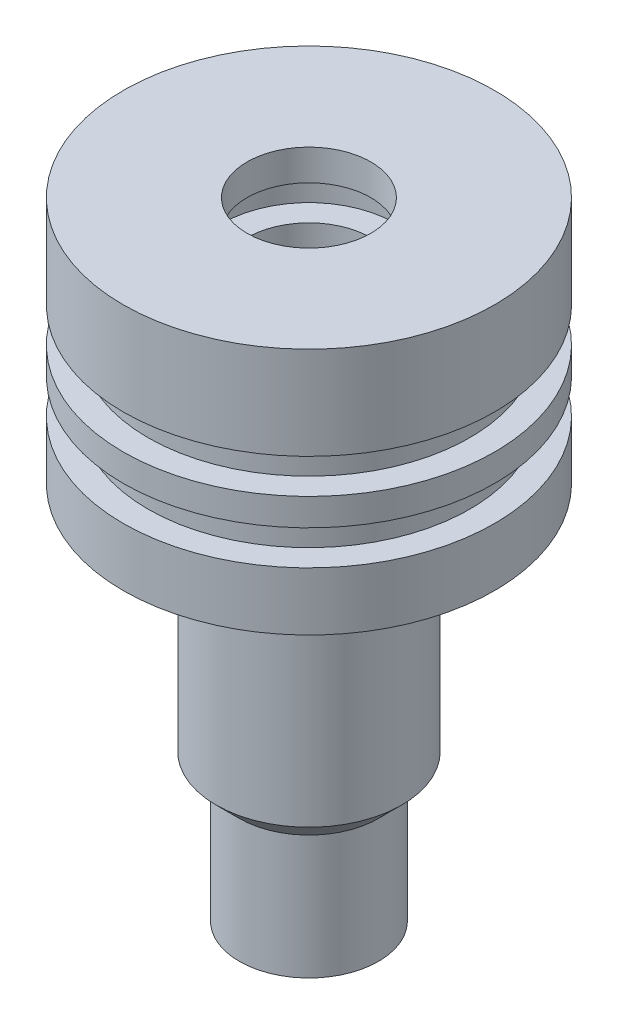
ISO-10303-21;
HEADER;
FILE_DESCRIPTION(('STEP AP214'),'2;1');
FILE_NAME('part.step','',(''),(''),'','','');
FILE_SCHEMA(('AUTOMOTIVE_DESIGN { 1 0 10303 214 1 1 1 1 }'));
ENDSEC;
DATA;
#1=APPLICATION_CONTEXT('core data for automotive mechanical design processes');
#2=APPLICATION_PROTOCOL_DEFINITION('international standard','automotive_design',2000,#1);
#3=PRODUCT_CONTEXT('',#1,'mechanical');
#4=PRODUCT('Part','Part','',(#3));
#5=PRODUCT_RELATED_PRODUCT_CATEGORY('part','',(#4));
#6=PRODUCT_DEFINITION_FORMATION('','',#4);
#7=PRODUCT_DEFINITION_CONTEXT('part definition',#1,'design');
#8=PRODUCT_DEFINITION('design','',#6,#7);
#9=PRODUCT_DEFINITION_SHAPE('','',#8);
#10=(LENGTH_UNIT() NAMED_UNIT(*) SI_UNIT(.MILLI.,.METRE.));
#11=(NAMED_UNIT(*) PLANE_ANGLE_UNIT() SI_UNIT($,.RADIAN.));
#12=(NAMED_UNIT(*) SI_UNIT($,.STERADIAN.) SOLID_ANGLE_UNIT());
#13=UNCERTAINTY_MEASURE_WITH_UNIT(LENGTH_MEASURE(1.E-05),#10,'distance_accuracy_value','');
#14=(GEOMETRIC_REPRESENTATION_CONTEXT(3) GLOBAL_UNCERTAINTY_ASSIGNED_CONTEXT((#13)) GLOBAL_UNIT_ASSIGNED_CONTEXT((#10,
#11,#12)) REPRESENTATION_CONTEXT('',''));
#15=CARTESIAN_POINT('',(0.,0.,0.));
#16=DIRECTION('',(0.,0.,1.));
#17=DIRECTION('',(1.,0.,0.));
#18=AXIS2_PLACEMENT_3D('',#15,#16,#17);
#19=CARTESIAN_POINT('',(0.,0.,0.));
#20=DIRECTION('',(0.,1.,0.));
#21=DIRECTION('',(0.,0.,1.));
#22=AXIS2_PLACEMENT_3D('',#19,#20,#21);
#23=CYLINDRICAL_SURFACE('',#22,6.35);
#24=CARTESIAN_POINT('',(0.,0.,0.));
#25=DIRECTION('',(0.,1.,0.));
#26=DIRECTION('',(0.,0.,1.));
#27=AXIS2_PLACEMENT_3D('',#24,#25,#26);
#28=CIRCLE('',#27,6.35);
#29=CARTESIAN_POINT('',(0.,0.,6.35));
#30=VERTEX_POINT('',#29);
#31=EDGE_CURVE('E113',#30,#30,#28,.T.);
#32=ORIENTED_EDGE('',*,*,#31,.T.);
#33=EDGE_LOOP('',(#32));
#34=FACE_BOUND('',#33,.T.);
#35=CARTESIAN_POINT('',(0.,-3.175,0.));
#36=DIRECTION('',(0.,1.,0.));
#37=DIRECTION('',(0.,0.,1.));
#38=AXIS2_PLACEMENT_3D('',#35,#36,#37);
#39=CIRCLE('',#38,6.35);
#40=CARTESIAN_POINT('',(0.,-3.175,6.35));
#41=VERTEX_POINT('',#40);
#42=EDGE_CURVE('E10',#41,#41,#39,.T.);
#43=ORIENTED_EDGE('',*,*,#42,.F.);
#44=EDGE_LOOP('',(#43));
#45=FACE_BOUND('',#44,.T.);
#46=ADVANCED_FACE('F37',(#34,#45),#23,.F.);
#47=CARTESIAN_POINT('',(-8.89,-3.175,0.));
#48=DIRECTION('',(0.,-1.,0.));
#49=DIRECTION('',(0.,0.,-1.));
#50=AXIS2_PLACEMENT_3D('',#47,#48,#49);
#51=PLANE('',#50);
#52=ORIENTED_EDGE('',*,*,#42,.T.);
#53=EDGE_LOOP('',(#52));
#54=FACE_BOUND('',#53,.T.);
#55=CARTESIAN_POINT('',(0.,-3.175,0.));
#56=DIRECTION('',(0.,1.,0.));
#57=DIRECTION('',(0.,0.,1.));
#58=AXIS2_PLACEMENT_3D('',#55,#56,#57);
#59=CIRCLE('',#58,8.89);
#60=CARTESIAN_POINT('',(0.,-3.175,8.89));
#61=VERTEX_POINT('',#60);
#62=EDGE_CURVE('E43',#61,#61,#59,.T.);
#63=ORIENTED_EDGE('',*,*,#62,.F.);
#64=EDGE_LOOP('',(#63));
#65=FACE_BOUND('',#64,.T.);
#66=ADVANCED_FACE('F131',(#54,#65),#51,.T.);
#67=CARTESIAN_POINT('',(0.,0.,0.));
#68=DIRECTION('',(0.,1.,0.));
#69=DIRECTION('',(0.,0.,1.));
#70=AXIS2_PLACEMENT_3D('',#67,#68,#69);
#71=CYLINDRICAL_SURFACE('',#70,8.89);
#72=ORIENTED_EDGE('',*,*,#62,.T.);
#73=EDGE_LOOP('',(#72));
#74=FACE_BOUND('',#73,.T.);
#75=CARTESIAN_POINT('',(0.,-6.731,0.));
#76=DIRECTION('',(0.,1.,0.));
#77=DIRECTION('',(0.,0.,1.));
#78=AXIS2_PLACEMENT_3D('',#75,#76,#77);
#79=CIRCLE('',#78,8.89);
#80=CARTESIAN_POINT('',(0.,-6.731,8.89));
#81=VERTEX_POINT('',#80);
#82=EDGE_CURVE('E47',#81,#81,#79,.T.);
#83=ORIENTED_EDGE('',*,*,#82,.F.);
#84=EDGE_LOOP('',(#83));
#85=FACE_BOUND('',#84,.T.);
#86=ADVANCED_FACE('F135',(#74,#85),#71,.F.);
#87=CARTESIAN_POINT('',(-6.35,-6.731,0.));
#88=DIRECTION('',(0.,1.,0.));
#89=DIRECTION('',(0.,0.,1.));
#90=AXIS2_PLACEMENT_3D('',#87,#88,#89);
#91=PLANE('',#90);
#92=ORIENTED_EDGE('',*,*,#82,.T.);
#93=EDGE_LOOP('',(#92));
#94=FACE_BOUND('',#93,.T.);
#95=CARTESIAN_POINT('',(0.,-6.731,0.));
#96=DIRECTION('',(0.,1.,0.));
#97=DIRECTION('',(0.,0.,1.));
#98=AXIS2_PLACEMENT_3D('',#95,#96,#97);
#99=CIRCLE('',#98,6.35);
#100=CARTESIAN_POINT('',(0.,-6.731,6.35));
#101=VERTEX_POINT('',#100);
#102=EDGE_CURVE('E51',#101,#101,#99,.T.);
#103=ORIENTED_EDGE('',*,*,#102,.F.);
#104=EDGE_LOOP('',(#103));
#105=FACE_BOUND('',#104,.T.);
#106=ADVANCED_FACE('F139',(#94,#105),#91,.T.);
#107=CARTESIAN_POINT('',(0.,0.,0.));
#108=DIRECTION('',(0.,1.,0.));
#109=DIRECTION('',(0.,0.,1.));
#110=AXIS2_PLACEMENT_3D('',#107,#108,#109);
#111=CYLINDRICAL_SURFACE('',#110,6.35);
#112=ORIENTED_EDGE('',*,*,#102,.T.);
#113=EDGE_LOOP('',(#112));
#114=FACE_BOUND('',#113,.T.);
#115=CARTESIAN_POINT('',(0.,-9.525,0.));
#116=DIRECTION('',(0.,1.,0.));
#117=DIRECTION('',(0.,0.,1.));
#118=AXIS2_PLACEMENT_3D('',#115,#116,#117);
#119=CIRCLE('',#118,6.35);
#120=CARTESIAN_POINT('',(0.,-9.525,6.35));
#121=VERTEX_POINT('',#120);
#122=EDGE_CURVE('E56',#121,#121,#119,.T.);
#123=ORIENTED_EDGE('',*,*,#122,.F.);
#124=EDGE_LOOP('',(#123));
#125=FACE_BOUND('',#124,.T.);
#126=ADVANCED_FACE('F145',(#114,#125),#111,.F.);
#127=CARTESIAN_POINT('',(-8.89,-9.525,0.));
#128=DIRECTION('',(0.,-1.,0.));
#129=DIRECTION('',(0.,0.,-1.));
#130=AXIS2_PLACEMENT_3D('',#127,#128,#129);
#131=PLANE('',#130);
#132=ORIENTED_EDGE('',*,*,#122,.T.);
#133=EDGE_LOOP('',(#132));
#134=FACE_BOUND('',#133,.T.);
#135=CARTESIAN_POINT('',(0.,-9.525,0.));
#136=DIRECTION('',(0.,1.,0.));
#137=DIRECTION('',(0.,0.,1.));
#138=AXIS2_PLACEMENT_3D('',#135,#136,#137);
#139=CIRCLE('',#138,8.89);
#140=CARTESIAN_POINT('',(0.,-9.525,8.89));
#141=VERTEX_POINT('',#140);
#142=EDGE_CURVE('E59',#141,#141,#139,.T.);
#143=ORIENTED_EDGE('',*,*,#142,.F.);
#144=EDGE_LOOP('',(#143));
#145=FACE_BOUND('',#144,.T.);
#146=ADVANCED_FACE('F149',(#134,#145),#131,.T.);
#147=CARTESIAN_POINT('',(0.,0.,0.));
#148=DIRECTION('',(0.,1.,0.));
#149=DIRECTION('',(0.,0.,1.));
#150=AXIS2_PLACEMENT_3D('',#147,#148,#149);
#151=CYLINDRICAL_SURFACE('',#150,8.89);
#152=ORIENTED_EDGE('',*,*,#142,.T.);
#153=EDGE_LOOP('',(#152));
#154=FACE_BOUND('',#153,.T.);
#155=CARTESIAN_POINT('',(0.,-13.081,0.));
#156=DIRECTION('',(0.,1.,0.));
#157=DIRECTION('',(0.,0.,1.));
#158=AXIS2_PLACEMENT_3D('',#155,#156,#157);
#159=CIRCLE('',#158,8.89);
#160=CARTESIAN_POINT('',(0.,-13.081,8.89));
#161=VERTEX_POINT('',#160);
#162=EDGE_CURVE('E62',#161,#161,#159,.T.);
#163=ORIENTED_EDGE('',*,*,#162,.F.);
#164=EDGE_LOOP('',(#163));
#165=FACE_BOUND('',#164,.T.);
#166=ADVANCED_FACE('F153',(#154,#165),#151,.F.);
#167=CARTESIAN_POINT('',(-6.35,-13.081,0.));
#168=DIRECTION('',(0.,1.,0.));
#169=DIRECTION('',(0.,0.,1.));
#170=AXIS2_PLACEMENT_3D('',#167,#168,#169);
#171=PLANE('',#170);
#172=ORIENTED_EDGE('',*,*,#162,.T.);
#173=EDGE_LOOP('',(#172));
#174=FACE_BOUND('',#173,.T.);
#175=CARTESIAN_POINT('',(0.,-13.081,0.));
#176=DIRECTION('',(0.,1.,0.));
#177=DIRECTION('',(0.,0.,1.));
#178=AXIS2_PLACEMENT_3D('',#175,#176,#177);
#179=CIRCLE('',#178,6.35);
#180=CARTESIAN_POINT('',(0.,-13.081,6.35));
#181=VERTEX_POINT('',#180);
#182=EDGE_CURVE('E65',#181,#181,#179,.T.);
#183=ORIENTED_EDGE('',*,*,#182,.F.);
#184=EDGE_LOOP('',(#183));
#185=FACE_BOUND('',#184,.T.);
#186=ADVANCED_FACE('F157',(#174,#185),#171,.T.);
#187=CARTESIAN_POINT('',(0.,0.,0.));
#188=DIRECTION('',(0.,1.,0.));
#189=DIRECTION('',(0.,0.,1.));
#190=AXIS2_PLACEMENT_3D('',#187,#188,#189);
#191=CYLINDRICAL_SURFACE('',#190,6.34999999999999);
#192=ORIENTED_EDGE('',*,*,#182,.T.);
#193=EDGE_LOOP('',(#192));
#194=FACE_BOUND('',#193,.T.);
#195=CARTESIAN_POINT('',(0.,-64.29375,0.));
#196=DIRECTION('',(0.,1.,0.));
#197=DIRECTION('',(0.,0.,1.));
#198=AXIS2_PLACEMENT_3D('',#195,#196,#197);
#199=CIRCLE('',#198,6.34999999999999);
#200=CARTESIAN_POINT('',(0.,-64.29375,6.34999999999999));
#201=VERTEX_POINT('',#200);
#202=EDGE_CURVE('E68',#201,#201,#199,.T.);
#203=ORIENTED_EDGE('',*,*,#202,.F.);
#204=EDGE_LOOP('',(#203));
#205=FACE_BOUND('',#204,.T.);
#206=ADVANCED_FACE('F161',(#194,#205),#191,.F.);
#207=CARTESIAN_POINT('',(-6.34999999999999,-64.29375,0.));
#208=DIRECTION('',(0.,-1.,0.));
#209=DIRECTION('',(0.,0.,-1.));
#210=AXIS2_PLACEMENT_3D('',#207,#208,#209);
#211=PLANE('',#210);
#212=ORIENTED_EDGE('',*,*,#202,.T.);
#213=EDGE_LOOP('',(#212));
#214=FACE_BOUND('',#213,.T.);
#215=CARTESIAN_POINT('',(0.,-64.29375,0.));
#216=DIRECTION('',(0.,1.,0.));
#217=DIRECTION('',(0.,0.,1.));
#218=AXIS2_PLACEMENT_3D('',#215,#216,#217);
#219=CIRCLE('',#218,7.14374999999999);
#220=CARTESIAN_POINT('',(0.,-64.29375,7.14374999999999));
#221=VERTEX_POINT('',#220);
#222=EDGE_CURVE('E71',#221,#221,#219,.T.);
#223=ORIENTED_EDGE('',*,*,#222,.F.);
#224=EDGE_LOOP('',(#223));
#225=FACE_BOUND('',#224,.T.);
#226=ADVANCED_FACE('F165',(#214,#225),#211,.T.);
#227=CARTESIAN_POINT('',(0.,0.,0.));
#228=DIRECTION('',(0.,1.,0.));
#229=DIRECTION('',(0.,0.,1.));
#230=AXIS2_PLACEMENT_3D('',#227,#228,#229);
#231=CYLINDRICAL_SURFACE('',#230,7.14374999999999);
#232=ORIENTED_EDGE('',*,*,#222,.T.);
#233=EDGE_LOOP('',(#232));
#234=FACE_BOUND('',#233,.T.);
#235=CARTESIAN_POINT('',(0.,-51.59375,0.));
#236=DIRECTION('',(0.,1.,0.));
#237=DIRECTION('',(0.,0.,1.));
#238=AXIS2_PLACEMENT_3D('',#235,#236,#237);
#239=CIRCLE('',#238,7.14374999999999);
#240=CARTESIAN_POINT('',(0.,-51.59375,7.14374999999999));
#241=VERTEX_POINT('',#240);
#242=EDGE_CURVE('E74',#241,#241,#239,.T.);
#243=ORIENTED_EDGE('',*,*,#242,.F.);
#244=EDGE_LOOP('',(#243));
#245=FACE_BOUND('',#244,.T.);
#246=ADVANCED_FACE('F169',(#234,#245),#231,.T.);
#247=CARTESIAN_POINT('',(0.,-49.2125,0.));
#248=DIRECTION('',(0.,1.,0.));
#249=DIRECTION('',(0.,0.,1.));
#250=AXIS2_PLACEMENT_3D('',#247,#248,#249);
#251=CONICAL_SURFACE('',#250,9.525,0.785398163397447);
#252=ORIENTED_EDGE('',*,*,#242,.T.);
#253=EDGE_LOOP('',(#252));
#254=FACE_BOUND('',#253,.T.);
#255=CARTESIAN_POINT('',(0.,-49.2125,0.));
#256=DIRECTION('',(0.,1.,0.));
#257=DIRECTION('',(0.,0.,1.));
#258=AXIS2_PLACEMENT_3D('',#255,#256,#257);
#259=CIRCLE('',#258,9.525);
#260=CARTESIAN_POINT('',(0.,-49.2125,9.525));
#261=VERTEX_POINT('',#260);
#262=EDGE_CURVE('E77',#261,#261,#259,.T.);
#263=ORIENTED_EDGE('',*,*,#262,.F.);
#264=EDGE_LOOP('',(#263));
#265=FACE_BOUND('',#264,.T.);
#266=ADVANCED_FACE('F173',(#254,#265),#251,.T.);
#267=CARTESIAN_POINT('',(0.,0.,0.));
#268=DIRECTION('',(0.,1.,0.));
#269=DIRECTION('',(0.,0.,1.));
#270=AXIS2_PLACEMENT_3D('',#267,#268,#269);
#271=CYLINDRICAL_SURFACE('',#270,9.525);
#272=ORIENTED_EDGE('',*,*,#262,.T.);
#273=EDGE_LOOP('',(#272));
#274=FACE_BOUND('',#273,.T.);
#275=CARTESIAN_POINT('',(0.,-25.4,0.));
#276=DIRECTION('',(0.,1.,0.));
#277=DIRECTION('',(0.,0.,1.));
#278=AXIS2_PLACEMENT_3D('',#275,#276,#277);
#279=CIRCLE('',#278,9.525);
#280=CARTESIAN_POINT('',(0.,-25.4,9.525));
#281=VERTEX_POINT('',#280);
#282=EDGE_CURVE('E80',#281,#281,#279,.T.);
#283=ORIENTED_EDGE('',*,*,#282,.F.);
#284=EDGE_LOOP('',(#283));
#285=FACE_BOUND('',#284,.T.);
#286=ADVANCED_FACE('F177',(#274,#285),#271,.T.);
#287=CARTESIAN_POINT('',(-9.525,-25.4,0.));
#288=DIRECTION('',(0.,-1.,0.));
#289=DIRECTION('',(0.,0.,-1.));
#290=AXIS2_PLACEMENT_3D('',#287,#288,#289);
#291=PLANE('',#290);
#292=ORIENTED_EDGE('',*,*,#282,.T.);
#293=EDGE_LOOP('',(#292));
#294=FACE_BOUND('',#293,.T.);
#295=CARTESIAN_POINT('',(0.,-25.4,0.));
#296=DIRECTION('',(0.,1.,0.));
#297=DIRECTION('',(0.,0.,1.));
#298=AXIS2_PLACEMENT_3D('',#295,#296,#297);
#299=CIRCLE('',#298,19.05);
#300=CARTESIAN_POINT('',(0.,-25.4,19.05));
#301=VERTEX_POINT('',#300);
#302=EDGE_CURVE('E83',#301,#301,#299,.T.);
#303=ORIENTED_EDGE('',*,*,#302,.F.);
#304=EDGE_LOOP('',(#303));
#305=FACE_BOUND('',#304,.T.);
#306=ADVANCED_FACE('F181',(#294,#305),#291,.T.);
#307=CARTESIAN_POINT('',(0.,0.,0.));
#308=DIRECTION('',(0.,1.,0.));
#309=DIRECTION('',(0.,0.,1.));
#310=AXIS2_PLACEMENT_3D('',#307,#308,#309);
#311=CYLINDRICAL_SURFACE('',#310,19.05);
#312=ORIENTED_EDGE('',*,*,#302,.T.);
#313=EDGE_LOOP('',(#312));
#314=FACE_BOUND('',#313,.T.);
#315=CARTESIAN_POINT('',(0.,-19.431,0.));
#316=DIRECTION('',(0.,1.,0.));
#317=DIRECTION('',(0.,0.,1.));
#318=AXIS2_PLACEMENT_3D('',#315,#316,#317);
#319=CIRCLE('',#318,19.05);
#320=CARTESIAN_POINT('',(0.,-19.431,19.05));
#321=VERTEX_POINT('',#320);
#322=EDGE_CURVE('E86',#321,#321,#319,.T.);
#323=ORIENTED_EDGE('',*,*,#322,.F.);
#324=EDGE_LOOP('',(#323));
#325=FACE_BOUND('',#324,.T.);
#326=ADVANCED_FACE('F185',(#314,#325),#311,.T.);
#327=CARTESIAN_POINT('',(-19.05,-19.431,0.));
#328=DIRECTION('',(0.,1.,0.));
#329=DIRECTION('',(0.,0.,1.));
#330=AXIS2_PLACEMENT_3D('',#327,#328,#329);
#331=PLANE('',#330);
#332=ORIENTED_EDGE('',*,*,#322,.T.);
#333=EDGE_LOOP('',(#332));
#334=FACE_BOUND('',#333,.T.);
#335=CARTESIAN_POINT('',(0.,-19.431,0.));
#336=DIRECTION('',(0.,1.,0.));
#337=DIRECTION('',(0.,0.,1.));
#338=AXIS2_PLACEMENT_3D('',#335,#336,#337);
#339=CIRCLE('',#338,16.51);
#340=CARTESIAN_POINT('',(0.,-19.431,16.51));
#341=VERTEX_POINT('',#340);
#342=EDGE_CURVE('E89',#341,#341,#339,.T.);
#343=ORIENTED_EDGE('',*,*,#342,.F.);
#344=EDGE_LOOP('',(#343));
#345=FACE_BOUND('',#344,.T.);
#346=ADVANCED_FACE('F189',(#334,#345),#331,.T.);
#347=CARTESIAN_POINT('',(0.,0.,0.));
#348=DIRECTION('',(0.,1.,0.));
#349=DIRECTION('',(0.,0.,1.));
#350=AXIS2_PLACEMENT_3D('',#347,#348,#349);
#351=CYLINDRICAL_SURFACE('',#350,16.51);
#352=ORIENTED_EDGE('',*,*,#342,.T.);
#353=EDGE_LOOP('',(#352));
#354=FACE_BOUND('',#353,.T.);
#355=CARTESIAN_POINT('',(0.,-15.875,0.));
#356=DIRECTION('',(0.,1.,0.));
#357=DIRECTION('',(0.,0.,1.));
#358=AXIS2_PLACEMENT_3D('',#355,#356,#357);
#359=CIRCLE('',#358,16.51);
#360=CARTESIAN_POINT('',(0.,-15.875,16.51));
#361=VERTEX_POINT('',#360);
#362=EDGE_CURVE('E92',#361,#361,#359,.T.);
#363=ORIENTED_EDGE('',*,*,#362,.F.);
#364=EDGE_LOOP('',(#363));
#365=FACE_BOUND('',#364,.T.);
#366=ADVANCED_FACE('F193',(#354,#365),#351,.T.);
#367=CARTESIAN_POINT('',(-16.51,-15.875,0.));
#368=DIRECTION('',(0.,-1.,0.));
#369=DIRECTION('',(0.,0.,-1.));
#370=AXIS2_PLACEMENT_3D('',#367,#368,#369);
#371=PLANE('',#370);
#372=ORIENTED_EDGE('',*,*,#362,.T.);
#373=EDGE_LOOP('',(#372));
#374=FACE_BOUND('',#373,.T.);
#375=CARTESIAN_POINT('',(0.,-15.875,0.));
#376=DIRECTION('',(0.,1.,0.));
#377=DIRECTION('',(0.,0.,1.));
#378=AXIS2_PLACEMENT_3D('',#375,#376,#377);
#379=CIRCLE('',#378,19.05);
#380=CARTESIAN_POINT('',(0.,-15.875,19.05));
#381=VERTEX_POINT('',#380);
#382=EDGE_CURVE('E95',#381,#381,#379,.T.);
#383=ORIENTED_EDGE('',*,*,#382,.F.);
#384=EDGE_LOOP('',(#383));
#385=FACE_BOUND('',#384,.T.);
#386=ADVANCED_FACE('F197',(#374,#385),#371,.T.);
#387=CARTESIAN_POINT('',(0.,0.,0.));
#388=DIRECTION('',(0.,1.,0.));
#389=DIRECTION('',(0.,0.,1.));
#390=AXIS2_PLACEMENT_3D('',#387,#388,#389);
#391=CYLINDRICAL_SURFACE('',#390,19.05);
#392=ORIENTED_EDGE('',*,*,#382,.T.);
#393=EDGE_LOOP('',(#392));
#394=FACE_BOUND('',#393,.T.);
#395=CARTESIAN_POINT('',(0.,-13.081,0.));
#396=DIRECTION('',(0.,1.,0.));
#397=DIRECTION('',(0.,0.,1.));
#398=AXIS2_PLACEMENT_3D('',#395,#396,#397);
#399=CIRCLE('',#398,19.05);
#400=CARTESIAN_POINT('',(0.,-13.081,19.05));
#401=VERTEX_POINT('',#400);
#402=EDGE_CURVE('E98',#401,#401,#399,.T.);
#403=ORIENTED_EDGE('',*,*,#402,.F.);
#404=EDGE_LOOP('',(#403));
#405=FACE_BOUND('',#404,.T.);
#406=ADVANCED_FACE('F201',(#394,#405),#391,.T.);
#407=CARTESIAN_POINT('',(-19.05,-13.081,0.));
#408=DIRECTION('',(0.,1.,0.));
#409=DIRECTION('',(0.,0.,1.));
#410=AXIS2_PLACEMENT_3D('',#407,#408,#409);
#411=PLANE('',#410);
#412=ORIENTED_EDGE('',*,*,#402,.T.);
#413=EDGE_LOOP('',(#412));
#414=FACE_BOUND('',#413,.T.);
#415=CARTESIAN_POINT('',(0.,-13.081,0.));
#416=DIRECTION('',(0.,1.,0.));
#417=DIRECTION('',(0.,0.,1.));
#418=AXIS2_PLACEMENT_3D('',#415,#416,#417);
#419=CIRCLE('',#418,16.51);
#420=CARTESIAN_POINT('',(0.,-13.081,16.51));
#421=VERTEX_POINT('',#420);
#422=EDGE_CURVE('E101',#421,#421,#419,.T.);
#423=ORIENTED_EDGE('',*,*,#422,.F.);
#424=EDGE_LOOP('',(#423));
#425=FACE_BOUND('',#424,.T.);
#426=ADVANCED_FACE('F205',(#414,#425),#411,.T.);
#427=CARTESIAN_POINT('',(0.,0.,0.));
#428=DIRECTION('',(0.,1.,0.));
#429=DIRECTION('',(0.,0.,1.));
#430=AXIS2_PLACEMENT_3D('',#427,#428,#429);
#431=CYLINDRICAL_SURFACE('',#430,16.51);
#432=ORIENTED_EDGE('',*,*,#422,.T.);
#433=EDGE_LOOP('',(#432));
#434=FACE_BOUND('',#433,.T.);
#435=CARTESIAN_POINT('',(0.,-9.525,0.));
#436=DIRECTION('',(0.,1.,0.));
#437=DIRECTION('',(0.,0.,1.));
#438=AXIS2_PLACEMENT_3D('',#435,#436,#437);
#439=CIRCLE('',#438,16.51);
#440=CARTESIAN_POINT('',(0.,-9.525,16.51));
#441=VERTEX_POINT('',#440);
#442=EDGE_CURVE('E104',#441,#441,#439,.T.);
#443=ORIENTED_EDGE('',*,*,#442,.F.);
#444=EDGE_LOOP('',(#443));
#445=FACE_BOUND('',#444,.T.);
#446=ADVANCED_FACE('F209',(#434,#445),#431,.T.);
#447=CARTESIAN_POINT('',(-16.51,-9.525,0.));
#448=DIRECTION('',(0.,-1.,0.));
#449=DIRECTION('',(0.,0.,-1.));
#450=AXIS2_PLACEMENT_3D('',#447,#448,#449);
#451=PLANE('',#450);
#452=ORIENTED_EDGE('',*,*,#442,.T.);
#453=EDGE_LOOP('',(#452));
#454=FACE_BOUND('',#453,.T.);
#455=CARTESIAN_POINT('',(0.,-9.525,0.));
#456=DIRECTION('',(0.,1.,0.));
#457=DIRECTION('',(0.,0.,1.));
#458=AXIS2_PLACEMENT_3D('',#455,#456,#457);
#459=CIRCLE('',#458,19.05);
#460=CARTESIAN_POINT('',(0.,-9.525,19.05));
#461=VERTEX_POINT('',#460);
#462=EDGE_CURVE('E107',#461,#461,#459,.T.);
#463=ORIENTED_EDGE('',*,*,#462,.F.);
#464=EDGE_LOOP('',(#463));
#465=FACE_BOUND('',#464,.T.);
#466=ADVANCED_FACE('F127',(#454,#465),#451,.T.);
#467=CARTESIAN_POINT('',(0.,0.,0.));
#468=DIRECTION('',(0.,1.,0.));
#469=DIRECTION('',(0.,0.,1.));
#470=AXIS2_PLACEMENT_3D('',#467,#468,#469);
#471=CYLINDRICAL_SURFACE('',#470,19.05);
#472=ORIENTED_EDGE('',*,*,#462,.T.);
#473=EDGE_LOOP('',(#472));
#474=FACE_BOUND('',#473,.T.);
#475=CARTESIAN_POINT('',(0.,0.,0.));
#476=DIRECTION('',(0.,1.,0.));
#477=DIRECTION('',(0.,0.,1.));
#478=AXIS2_PLACEMENT_3D('',#475,#476,#477);
#479=CIRCLE('',#478,19.05);
#480=CARTESIAN_POINT('',(0.,0.,19.05));
#481=VERTEX_POINT('',#480);
#482=EDGE_CURVE('E110',#481,#481,#479,.T.);
#483=ORIENTED_EDGE('',*,*,#482,.F.);
#484=EDGE_LOOP('',(#483));
#485=FACE_BOUND('',#484,.T.);
#486=ADVANCED_FACE('F121',(#474,#485),#471,.T.);
#487=CARTESIAN_POINT('',(-19.05,0.,0.));
#488=DIRECTION('',(0.,1.,0.));
#489=DIRECTION('',(0.,0.,1.));
#490=AXIS2_PLACEMENT_3D('',#487,#488,#489);
#491=PLANE('',#490);
#492=ORIENTED_EDGE('',*,*,#482,.T.);
#493=EDGE_LOOP('',(#492));
#494=FACE_BOUND('',#493,.T.);
#495=ORIENTED_EDGE('',*,*,#31,.F.);
#496=EDGE_LOOP('',(#495));
#497=FACE_BOUND('',#496,.T.);
#498=ADVANCED_FACE('F119',(#494,#497),#491,.T.);
#499=CLOSED_SHELL('',(#46,#66,#86,#106,#126,#146,#166,#186,#206,#226,#246,#266,#286,#306,#326,
#346,#366,#386,#406,#426,#446,#466,#486,#498));
#500=MANIFOLD_SOLID_BREP('B2',#499);
#501=ADVANCED_BREP_SHAPE_REPRESENTATION('',(#18,#500),#14);
#502=SHAPE_DEFINITION_REPRESENTATION(#9,#501);
ENDSEC;
END-ISO-10303-21;
